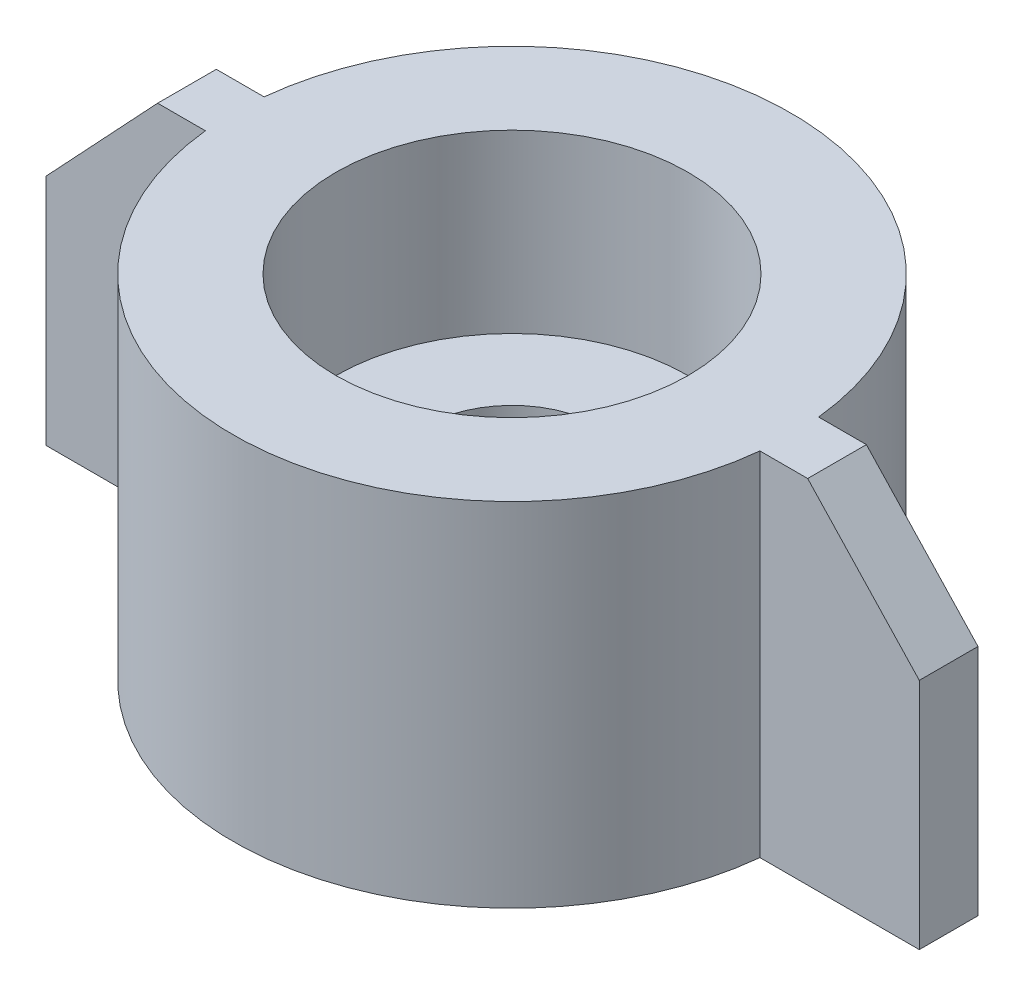
ISO-10303-21;
HEADER;
FILE_DESCRIPTION(('STEP AP214'),'2;1');
FILE_NAME('part.step','',(''),(''),'','','');
FILE_SCHEMA(('AUTOMOTIVE_DESIGN { 1 0 10303 214 1 1 1 1 }'));
ENDSEC;
DATA;
#1=APPLICATION_CONTEXT('core data for automotive mechanical design processes');
#2=APPLICATION_PROTOCOL_DEFINITION('international standard','automotive_design',2000,#1);
#3=PRODUCT_CONTEXT('',#1,'mechanical');
#4=PRODUCT('Part','Part','',(#3));
#5=PRODUCT_RELATED_PRODUCT_CATEGORY('part','',(#4));
#6=PRODUCT_DEFINITION_FORMATION('','',#4);
#7=PRODUCT_DEFINITION_CONTEXT('part definition',#1,'design');
#8=PRODUCT_DEFINITION('design','',#6,#7);
#9=PRODUCT_DEFINITION_SHAPE('','',#8);
#10=(LENGTH_UNIT() NAMED_UNIT(*) SI_UNIT(.MILLI.,.METRE.));
#11=(NAMED_UNIT(*) PLANE_ANGLE_UNIT() SI_UNIT($,.RADIAN.));
#12=(NAMED_UNIT(*) SI_UNIT($,.STERADIAN.) SOLID_ANGLE_UNIT());
#13=UNCERTAINTY_MEASURE_WITH_UNIT(LENGTH_MEASURE(1.E-05),#10,'distance_accuracy_value','');
#14=(GEOMETRIC_REPRESENTATION_CONTEXT(3) GLOBAL_UNCERTAINTY_ASSIGNED_CONTEXT((#13)) GLOBAL_UNIT_ASSIGNED_CONTEXT((#10,
#11,#12)) REPRESENTATION_CONTEXT('',''));
#15=CARTESIAN_POINT('',(0.,0.,0.));
#16=DIRECTION('',(0.,0.,1.));
#17=DIRECTION('',(1.,0.,0.));
#18=AXIS2_PLACEMENT_3D('',#15,#16,#17);
#19=CARTESIAN_POINT('',(0.,12.,0.));
#20=DIRECTION('',(0.,-1.,0.));
#21=DIRECTION('',(0.,0.,-1.));
#22=AXIS2_PLACEMENT_3D('',#19,#20,#21);
#23=CYLINDRICAL_SURFACE('',#22,6.);
#24=CARTESIAN_POINT('',(0.,0.,0.));
#25=DIRECTION('',(0.,1.,0.));
#26=DIRECTION('',(0.,0.,1.));
#27=AXIS2_PLACEMENT_3D('',#24,#25,#26);
#28=CIRCLE('',#27,6.);
#29=CARTESIAN_POINT('',(0.,0.,6.));
#30=VERTEX_POINT('',#29);
#31=EDGE_CURVE('E178',#30,#30,#28,.T.);
#32=ORIENTED_EDGE('',*,*,#31,.F.);
#33=EDGE_LOOP('',(#32));
#34=FACE_BOUND('',#33,.T.);
#35=CARTESIAN_POINT('',(0.,4.,0.));
#36=DIRECTION('',(0.,1.,0.));
#37=DIRECTION('',(0.,0.,1.));
#38=AXIS2_PLACEMENT_3D('',#35,#36,#37);
#39=CIRCLE('',#38,6.);
#40=CARTESIAN_POINT('',(0.,4.,6.));
#41=VERTEX_POINT('',#40);
#42=EDGE_CURVE('E393',#41,#41,#39,.T.);
#43=ORIENTED_EDGE('',*,*,#42,.T.);
#44=EDGE_LOOP('',(#43));
#45=FACE_BOUND('',#44,.T.);
#46=ADVANCED_FACE('F33',(#34,#45),#23,.F.);
#47=CARTESIAN_POINT('',(0.,12.,0.));
#48=DIRECTION('',(0.,-1.,0.));
#49=DIRECTION('',(0.,0.,-1.));
#50=AXIS2_PLACEMENT_3D('',#47,#48,#49);
#51=CYLINDRICAL_SURFACE('',#50,9.5);
#52=DIRECTION('',(0.,-1.,0.));
#53=VECTOR('',#52,1.);
#54=CARTESIAN_POINT('',(-9.44722181384559,12.,1.));
#55=LINE('',#54,#53);
#56=CARTESIAN_POINT('',(-9.44722181384559,0.,1.));
#57=VERTEX_POINT('',#56);
#58=CARTESIAN_POINT('',(-9.44722181384559,12.,1.));
#59=VERTEX_POINT('',#58);
#60=EDGE_CURVE('E152',#57,#59,#55,.F.);
#61=ORIENTED_EDGE('',*,*,#60,.F.);
#62=CARTESIAN_POINT('',(0.,0.,0.));
#63=DIRECTION('',(0.,1.,0.));
#64=DIRECTION('',(0.,0.,1.));
#65=AXIS2_PLACEMENT_3D('',#62,#63,#64);
#66=CIRCLE('',#65,9.5);
#67=CARTESIAN_POINT('',(9.44722181384559,0.,1.));
#68=VERTEX_POINT('',#67);
#69=EDGE_CURVE('E186',#57,#68,#66,.T.);
#70=ORIENTED_EDGE('',*,*,#69,.T.);
#71=DIRECTION('',(0.,-1.,0.));
#72=VECTOR('',#71,1.);
#73=CARTESIAN_POINT('',(9.44722181384559,12.,1.));
#74=LINE('',#73,#72);
#75=CARTESIAN_POINT('',(9.44722181384559,12.,1.));
#76=VERTEX_POINT('',#75);
#77=EDGE_CURVE('E192',#68,#76,#74,.F.);
#78=ORIENTED_EDGE('',*,*,#77,.T.);
#79=CARTESIAN_POINT('',(0.,12.,0.));
#80=DIRECTION('',(0.,1.,0.));
#81=DIRECTION('',(0.,0.,1.));
#82=AXIS2_PLACEMENT_3D('',#79,#80,#81);
#83=CIRCLE('',#82,9.5);
#84=EDGE_CURVE('E56',#59,#76,#83,.T.);
#85=ORIENTED_EDGE('',*,*,#84,.F.);
#86=EDGE_LOOP('',(#61,#70,#78,#85));
#87=FACE_BOUND('',#86,.T.);
#88=ADVANCED_FACE('F219',(#87),#51,.T.);
#89=CARTESIAN_POINT('',(9.44722181384559,0.,-1.));
#90=VERTEX_POINT('',#89);
#91=CARTESIAN_POINT('',(-9.44722181384559,0.,-1.));
#92=VERTEX_POINT('',#91);
#93=EDGE_CURVE('E193',#90,#92,#66,.T.);
#94=ORIENTED_EDGE('',*,*,#93,.T.);
#95=DIRECTION('',(0.,-1.,0.));
#96=VECTOR('',#95,1.);
#97=CARTESIAN_POINT('',(-9.44722181384559,12.,-1.));
#98=LINE('',#97,#96);
#99=CARTESIAN_POINT('',(-9.44722181384559,12.,-1.));
#100=VERTEX_POINT('',#99);
#101=EDGE_CURVE('E118',#92,#100,#98,.F.);
#102=ORIENTED_EDGE('',*,*,#101,.T.);
#103=CARTESIAN_POINT('',(9.44722181384559,12.,-1.));
#104=VERTEX_POINT('',#103);
#105=EDGE_CURVE('E189',#104,#100,#83,.T.);
#106=ORIENTED_EDGE('',*,*,#105,.F.);
#107=DIRECTION('',(0.,-1.,0.));
#108=VECTOR('',#107,1.);
#109=CARTESIAN_POINT('',(9.44722181384559,12.,-1.));
#110=LINE('',#109,#108);
#111=EDGE_CURVE('E41',#90,#104,#110,.F.);
#112=ORIENTED_EDGE('',*,*,#111,.F.);
#113=EDGE_LOOP('',(#94,#102,#106,#112));
#114=FACE_BOUND('',#113,.T.);
#115=ADVANCED_FACE('F35',(#114),#51,.T.);
#116=CARTESIAN_POINT('',(0.,12.,0.));
#117=DIRECTION('',(0.,1.,0.));
#118=DIRECTION('',(0.,0.,1.));
#119=AXIS2_PLACEMENT_3D('',#116,#117,#118);
#120=PLANE('',#119);
#121=ORIENTED_EDGE('',*,*,#105,.T.);
#122=DIRECTION('',(1.,0.,0.));
#123=VECTOR('',#122,1.);
#124=CARTESIAN_POINT('',(-11.0740312179161,12.,-1.));
#125=LINE('',#124,#123);
#126=CARTESIAN_POINT('',(-11.0740312179161,12.,-1.));
#127=VERTEX_POINT('',#126);
#128=EDGE_CURVE('E48',#127,#100,#125,.T.);
#129=ORIENTED_EDGE('',*,*,#128,.F.);
#130=DIRECTION('',(0.,0.,-1.));
#131=VECTOR('',#130,1.);
#132=CARTESIAN_POINT('',(-11.0740312179161,12.,1.));
#133=LINE('',#132,#131);
#134=CARTESIAN_POINT('',(-11.0740312179161,12.,1.));
#135=VERTEX_POINT('',#134);
#136=EDGE_CURVE('E148',#135,#127,#133,.T.);
#137=ORIENTED_EDGE('',*,*,#136,.F.);
#138=DIRECTION('',(1.,0.,0.));
#139=VECTOR('',#138,1.);
#140=CARTESIAN_POINT('',(-11.0740312179161,12.,1.));
#141=LINE('',#140,#139);
#142=EDGE_CURVE('E138',#135,#59,#141,.T.);
#143=ORIENTED_EDGE('',*,*,#142,.T.);
#144=ORIENTED_EDGE('',*,*,#84,.T.);
#145=DIRECTION('',(-1.,0.,0.));
#146=VECTOR('',#145,1.);
#147=CARTESIAN_POINT('',(11.0740312179161,12.,1.));
#148=LINE('',#147,#146);
#149=CARTESIAN_POINT('',(11.0740312179161,12.,1.));
#150=VERTEX_POINT('',#149);
#151=EDGE_CURVE('E154',#150,#76,#148,.T.);
#152=ORIENTED_EDGE('',*,*,#151,.F.);
#153=DIRECTION('',(0.,0.,1.));
#154=VECTOR('',#153,1.);
#155=CARTESIAN_POINT('',(11.0740312179161,12.,-1.));
#156=LINE('',#155,#154);
#157=CARTESIAN_POINT('',(11.0740312179161,12.,-1.));
#158=VERTEX_POINT('',#157);
#159=EDGE_CURVE('E176',#158,#150,#156,.T.);
#160=ORIENTED_EDGE('',*,*,#159,.F.);
#161=DIRECTION('',(-1.,0.,0.));
#162=VECTOR('',#161,1.);
#163=CARTESIAN_POINT('',(11.0740312179161,12.,-1.));
#164=LINE('',#163,#162);
#165=EDGE_CURVE('E164',#158,#104,#164,.T.);
#166=ORIENTED_EDGE('',*,*,#165,.T.);
#167=EDGE_LOOP('',(#121,#129,#137,#143,#144,#152,#160,#166));
#168=FACE_BOUND('',#167,.T.);
#169=CARTESIAN_POINT('',(0.,12.,0.));
#170=DIRECTION('',(0.,1.,0.));
#171=DIRECTION('',(0.,0.,1.));
#172=AXIS2_PLACEMENT_3D('',#169,#170,#171);
#173=CIRCLE('',#172,6.);
#174=CARTESIAN_POINT('',(0.,12.,6.));
#175=VERTEX_POINT('',#174);
#176=EDGE_CURVE('E183',#175,#175,#173,.T.);
#177=ORIENTED_EDGE('',*,*,#176,.F.);
#178=EDGE_LOOP('',(#177));
#179=FACE_BOUND('',#178,.T.);
#180=ADVANCED_FACE('F204',(#168,#179),#120,.T.);
#181=CARTESIAN_POINT('',(0.,0.,0.));
#182=DIRECTION('',(0.,1.,0.));
#183=DIRECTION('',(0.,0.,1.));
#184=AXIS2_PLACEMENT_3D('',#181,#182,#183);
#185=PLANE('',#184);
#186=ORIENTED_EDGE('',*,*,#69,.F.);
#187=DIRECTION('',(-1.,0.,0.));
#188=VECTOR('',#187,1.);
#189=CARTESIAN_POINT('',(-7.27132484583667,0.,1.));
#190=LINE('',#189,#188);
#191=CARTESIAN_POINT('',(-14.8767375899956,0.,1.));
#192=VERTEX_POINT('',#191);
#193=EDGE_CURVE('E128',#57,#192,#190,.T.);
#194=ORIENTED_EDGE('',*,*,#193,.T.);
#195=DIRECTION('',(0.,0.,-1.));
#196=VECTOR('',#195,1.);
#197=CARTESIAN_POINT('',(-14.8767375899956,0.,1.));
#198=LINE('',#197,#196);
#199=CARTESIAN_POINT('',(-14.8767375899956,0.,-1.));
#200=VERTEX_POINT('',#199);
#201=EDGE_CURVE('E124',#192,#200,#198,.T.);
#202=ORIENTED_EDGE('',*,*,#201,.T.);
#203=DIRECTION('',(-1.,0.,0.));
#204=VECTOR('',#203,1.);
#205=CARTESIAN_POINT('',(-7.27132484583667,0.,-1.));
#206=LINE('',#205,#204);
#207=EDGE_CURVE('E112',#92,#200,#206,.T.);
#208=ORIENTED_EDGE('',*,*,#207,.F.);
#209=ORIENTED_EDGE('',*,*,#93,.F.);
#210=DIRECTION('',(1.,0.,0.));
#211=VECTOR('',#210,1.);
#212=CARTESIAN_POINT('',(7.27132484583667,0.,-1.));
#213=LINE('',#212,#211);
#214=CARTESIAN_POINT('',(14.8767375899956,0.,-1.));
#215=VERTEX_POINT('',#214);
#216=EDGE_CURVE('E167',#90,#215,#213,.T.);
#217=ORIENTED_EDGE('',*,*,#216,.T.);
#218=DIRECTION('',(0.,0.,1.));
#219=VECTOR('',#218,1.);
#220=CARTESIAN_POINT('',(14.8767375899956,0.,-1.));
#221=LINE('',#220,#219);
#222=CARTESIAN_POINT('',(14.8767375899956,0.,1.));
#223=VERTEX_POINT('',#222);
#224=EDGE_CURVE('E175',#215,#223,#221,.T.);
#225=ORIENTED_EDGE('',*,*,#224,.T.);
#226=DIRECTION('',(1.,0.,0.));
#227=VECTOR('',#226,1.);
#228=CARTESIAN_POINT('',(7.27132484583667,0.,1.));
#229=LINE('',#228,#227);
#230=EDGE_CURVE('E156',#68,#223,#229,.T.);
#231=ORIENTED_EDGE('',*,*,#230,.F.);
#232=EDGE_LOOP('',(#186,#194,#202,#208,#209,#217,#225,#231));
#233=FACE_BOUND('',#232,.T.);
#234=ORIENTED_EDGE('',*,*,#31,.T.);
#235=EDGE_LOOP('',(#234));
#236=FACE_BOUND('',#235,.T.);
#237=ADVANCED_FACE('F126',(#233,#236),#185,.F.);
#238=CARTESIAN_POINT('',(0.,6.,0.));
#239=DIRECTION('',(0.,1.,0.));
#240=DIRECTION('',(0.,0.,1.));
#241=AXIS2_PLACEMENT_3D('',#238,#239,#240);
#242=CIRCLE('',#241,6.);
#243=CARTESIAN_POINT('',(0.,6.,6.));
#244=VERTEX_POINT('',#243);
#245=EDGE_CURVE('E11',#244,#244,#242,.T.);
#246=ORIENTED_EDGE('',*,*,#245,.F.);
#247=EDGE_LOOP('',(#246));
#248=FACE_BOUND('',#247,.T.);
#249=ORIENTED_EDGE('',*,*,#176,.T.);
#250=EDGE_LOOP('',(#249));
#251=FACE_BOUND('',#250,.T.);
#252=ADVANCED_FACE('F239',(#248,#251),#23,.F.);
#253=CARTESIAN_POINT('',(0.,0.,-1.));
#254=DIRECTION('',(0.,0.,1.));
#255=DIRECTION('',(1.,0.,0.));
#256=AXIS2_PLACEMENT_3D('',#253,#254,#255);
#257=PLANE('',#256);
#258=ORIENTED_EDGE('',*,*,#216,.F.);
#259=ORIENTED_EDGE('',*,*,#111,.T.);
#260=ORIENTED_EDGE('',*,*,#165,.F.);
#261=DIRECTION('',(-0.684101861560455,0.729386483977815,0.));
#262=VECTOR('',#261,1.);
#263=CARTESIAN_POINT('',(14.8767375899956,7.94557070199414,-1.));
#264=LINE('',#263,#262);
#265=CARTESIAN_POINT('',(14.8767375899956,7.94557070199414,-1.));
#266=VERTEX_POINT('',#265);
#267=EDGE_CURVE('E172',#266,#158,#264,.T.);
#268=ORIENTED_EDGE('',*,*,#267,.F.);
#269=DIRECTION('',(0.,1.,0.));
#270=VECTOR('',#269,1.);
#271=CARTESIAN_POINT('',(14.8767375899956,0.,-1.));
#272=LINE('',#271,#270);
#273=EDGE_CURVE('E169',#215,#266,#272,.T.);
#274=ORIENTED_EDGE('',*,*,#273,.F.);
#275=EDGE_LOOP('',(#258,#259,#260,#268,#274));
#276=FACE_BOUND('',#275,.T.);
#277=ADVANCED_FACE('F199',(#276),#257,.F.);
#278=CARTESIAN_POINT('',(0.,0.,1.));
#279=DIRECTION('',(0.,0.,1.));
#280=DIRECTION('',(1.,0.,0.));
#281=AXIS2_PLACEMENT_3D('',#278,#279,#280);
#282=PLANE('',#281);
#283=ORIENTED_EDGE('',*,*,#77,.F.);
#284=ORIENTED_EDGE('',*,*,#230,.T.);
#285=DIRECTION('',(0.,1.,0.));
#286=VECTOR('',#285,1.);
#287=CARTESIAN_POINT('',(14.8767375899956,0.,1.));
#288=LINE('',#287,#286);
#289=CARTESIAN_POINT('',(14.8767375899956,7.94557070199414,1.));
#290=VERTEX_POINT('',#289);
#291=EDGE_CURVE('E158',#223,#290,#288,.T.);
#292=ORIENTED_EDGE('',*,*,#291,.T.);
#293=DIRECTION('',(-0.684101861560455,0.729386483977815,0.));
#294=VECTOR('',#293,1.);
#295=CARTESIAN_POINT('',(14.8767375899956,7.94557070199414,1.));
#296=LINE('',#295,#294);
#297=EDGE_CURVE('E161',#290,#150,#296,.T.);
#298=ORIENTED_EDGE('',*,*,#297,.T.);
#299=ORIENTED_EDGE('',*,*,#151,.T.);
#300=EDGE_LOOP('',(#283,#284,#292,#298,#299));
#301=FACE_BOUND('',#300,.T.);
#302=ADVANCED_FACE('F216',(#301),#282,.T.);
#303=CARTESIAN_POINT('',(14.8767375899956,7.94557070199414,-1.));
#304=DIRECTION('',(0.729386483977815,0.684101861560455,0.));
#305=DIRECTION('',(-0.684101861560455,0.729386483977815,0.));
#306=AXIS2_PLACEMENT_3D('',#303,#304,#305);
#307=PLANE('',#306);
#308=ORIENTED_EDGE('',*,*,#159,.T.);
#309=ORIENTED_EDGE('',*,*,#297,.F.);
#310=DIRECTION('',(0.,0.,1.));
#311=VECTOR('',#310,1.);
#312=CARTESIAN_POINT('',(14.8767375899956,7.94557070199414,-1.));
#313=LINE('',#312,#311);
#314=EDGE_CURVE('E179',#266,#290,#313,.T.);
#315=ORIENTED_EDGE('',*,*,#314,.F.);
#316=ORIENTED_EDGE('',*,*,#267,.T.);
#317=EDGE_LOOP('',(#308,#309,#315,#316));
#318=FACE_BOUND('',#317,.T.);
#319=ADVANCED_FACE('F212',(#318),#307,.T.);
#320=CARTESIAN_POINT('',(14.8767375899956,0.,-1.));
#321=DIRECTION('',(1.,0.,0.));
#322=DIRECTION('',(0.,0.,-1.));
#323=AXIS2_PLACEMENT_3D('',#320,#321,#322);
#324=PLANE('',#323);
#325=ORIENTED_EDGE('',*,*,#314,.T.);
#326=ORIENTED_EDGE('',*,*,#291,.F.);
#327=ORIENTED_EDGE('',*,*,#224,.F.);
#328=ORIENTED_EDGE('',*,*,#273,.T.);
#329=EDGE_LOOP('',(#325,#326,#327,#328));
#330=FACE_BOUND('',#329,.T.);
#331=ADVANCED_FACE('F210',(#330),#324,.T.);
#332=CARTESIAN_POINT('',(0.,0.,1.));
#333=DIRECTION('',(0.,0.,-1.));
#334=DIRECTION('',(-1.,0.,0.));
#335=AXIS2_PLACEMENT_3D('',#332,#333,#334);
#336=PLANE('',#335);
#337=ORIENTED_EDGE('',*,*,#193,.F.);
#338=ORIENTED_EDGE('',*,*,#60,.T.);
#339=ORIENTED_EDGE('',*,*,#142,.F.);
#340=DIRECTION('',(0.684101861560455,0.729386483977815,0.));
#341=VECTOR('',#340,1.);
#342=CARTESIAN_POINT('',(-14.8767375899956,7.94557070199414,1.));
#343=LINE('',#342,#341);
#344=CARTESIAN_POINT('',(-14.8767375899956,7.94557070199414,1.));
#345=VERTEX_POINT('',#344);
#346=EDGE_CURVE('E133',#345,#135,#343,.T.);
#347=ORIENTED_EDGE('',*,*,#346,.F.);
#348=DIRECTION('',(0.,1.,0.));
#349=VECTOR('',#348,1.);
#350=CARTESIAN_POINT('',(-14.8767375899956,0.,1.));
#351=LINE('',#350,#349);
#352=EDGE_CURVE('E144',#192,#345,#351,.T.);
#353=ORIENTED_EDGE('',*,*,#352,.F.);
#354=EDGE_LOOP('',(#337,#338,#339,#347,#353));
#355=FACE_BOUND('',#354,.T.);
#356=ADVANCED_FACE('F222',(#355),#336,.F.);
#357=CARTESIAN_POINT('',(0.,0.,-1.));
#358=DIRECTION('',(0.,0.,-1.));
#359=DIRECTION('',(-1.,0.,0.));
#360=AXIS2_PLACEMENT_3D('',#357,#358,#359);
#361=PLANE('',#360);
#362=ORIENTED_EDGE('',*,*,#101,.F.);
#363=ORIENTED_EDGE('',*,*,#207,.T.);
#364=DIRECTION('',(0.,1.,0.));
#365=VECTOR('',#364,1.);
#366=CARTESIAN_POINT('',(-14.8767375899956,0.,-1.));
#367=LINE('',#366,#365);
#368=CARTESIAN_POINT('',(-14.8767375899956,7.94557070199414,-1.));
#369=VERTEX_POINT('',#368);
#370=EDGE_CURVE('E116',#200,#369,#367,.T.);
#371=ORIENTED_EDGE('',*,*,#370,.T.);
#372=DIRECTION('',(0.684101861560455,0.729386483977815,0.));
#373=VECTOR('',#372,1.);
#374=CARTESIAN_POINT('',(-14.8767375899956,7.94557070199414,-1.));
#375=LINE('',#374,#373);
#376=EDGE_CURVE('E136',#369,#127,#375,.T.);
#377=ORIENTED_EDGE('',*,*,#376,.T.);
#378=ORIENTED_EDGE('',*,*,#128,.T.);
#379=EDGE_LOOP('',(#362,#363,#371,#377,#378));
#380=FACE_BOUND('',#379,.T.);
#381=ADVANCED_FACE('F114',(#380),#361,.T.);
#382=CARTESIAN_POINT('',(-14.8767375899956,7.94557070199414,1.));
#383=DIRECTION('',(-0.729386483977815,0.684101861560455,0.));
#384=DIRECTION('',(-0.684101861560455,-0.729386483977815,0.));
#385=AXIS2_PLACEMENT_3D('',#382,#383,#384);
#386=PLANE('',#385);
#387=ORIENTED_EDGE('',*,*,#136,.T.);
#388=ORIENTED_EDGE('',*,*,#376,.F.);
#389=DIRECTION('',(0.,0.,-1.));
#390=VECTOR('',#389,1.);
#391=CARTESIAN_POINT('',(-14.8767375899956,7.94557070199414,1.));
#392=LINE('',#391,#390);
#393=EDGE_CURVE('E132',#345,#369,#392,.T.);
#394=ORIENTED_EDGE('',*,*,#393,.F.);
#395=ORIENTED_EDGE('',*,*,#346,.T.);
#396=EDGE_LOOP('',(#387,#388,#394,#395));
#397=FACE_BOUND('',#396,.T.);
#398=ADVANCED_FACE('F225',(#397),#386,.T.);
#399=CARTESIAN_POINT('',(-14.8767375899956,0.,1.));
#400=DIRECTION('',(-1.,0.,0.));
#401=DIRECTION('',(0.,0.,1.));
#402=AXIS2_PLACEMENT_3D('',#399,#400,#401);
#403=PLANE('',#402);
#404=ORIENTED_EDGE('',*,*,#393,.T.);
#405=ORIENTED_EDGE('',*,*,#370,.F.);
#406=ORIENTED_EDGE('',*,*,#201,.F.);
#407=ORIENTED_EDGE('',*,*,#352,.T.);
#408=EDGE_LOOP('',(#404,#405,#406,#407));
#409=FACE_BOUND('',#408,.T.);
#410=ADVANCED_FACE('F135',(#409),#403,.T.);
#411=CARTESIAN_POINT('',(0.,6.,0.));
#412=DIRECTION('',(0.,1.,0.));
#413=DIRECTION('',(0.,0.,1.));
#414=AXIS2_PLACEMENT_3D('',#411,#412,#413);
#415=PLANE('',#414);
#416=ORIENTED_EDGE('',*,*,#245,.T.);
#417=EDGE_LOOP('',(#416));
#418=FACE_BOUND('',#417,.T.);
#419=CARTESIAN_POINT('',(0.,6.,0.));
#420=DIRECTION('',(0.,1.,0.));
#421=DIRECTION('',(0.,0.,1.));
#422=AXIS2_PLACEMENT_3D('',#419,#420,#421);
#423=CIRCLE('',#422,3.);
#424=CARTESIAN_POINT('',(0.,6.,3.));
#425=VERTEX_POINT('',#424);
#426=EDGE_CURVE('E387',#425,#425,#423,.T.);
#427=ORIENTED_EDGE('',*,*,#426,.F.);
#428=EDGE_LOOP('',(#427));
#429=FACE_BOUND('',#428,.T.);
#430=ADVANCED_FACE('F232',(#418,#429),#415,.T.);
#431=CARTESIAN_POINT('',(0.,4.,0.));
#432=DIRECTION('',(0.,1.,0.));
#433=DIRECTION('',(0.,0.,1.));
#434=AXIS2_PLACEMENT_3D('',#431,#432,#433);
#435=PLANE('',#434);
#436=ORIENTED_EDGE('',*,*,#42,.F.);
#437=EDGE_LOOP('',(#436));
#438=FACE_BOUND('',#437,.T.);
#439=CARTESIAN_POINT('',(0.,4.,0.));
#440=DIRECTION('',(0.,1.,0.));
#441=DIRECTION('',(0.,0.,1.));
#442=AXIS2_PLACEMENT_3D('',#439,#440,#441);
#443=CIRCLE('',#442,3.);
#444=CARTESIAN_POINT('',(0.,4.,3.));
#445=VERTEX_POINT('',#444);
#446=EDGE_CURVE('E390',#445,#445,#443,.T.);
#447=ORIENTED_EDGE('',*,*,#446,.T.);
#448=EDGE_LOOP('',(#447));
#449=FACE_BOUND('',#448,.T.);
#450=ADVANCED_FACE('F335',(#438,#449),#435,.F.);
#451=CARTESIAN_POINT('',(0.,6.,0.));
#452=DIRECTION('',(0.,-1.,0.));
#453=DIRECTION('',(0.,0.,-1.));
#454=AXIS2_PLACEMENT_3D('',#451,#452,#453);
#455=CYLINDRICAL_SURFACE('',#454,3.);
#456=ORIENTED_EDGE('',*,*,#426,.T.);
#457=EDGE_LOOP('',(#456));
#458=FACE_BOUND('',#457,.T.);
#459=ORIENTED_EDGE('',*,*,#446,.F.);
#460=EDGE_LOOP('',(#459));
#461=FACE_BOUND('',#460,.T.);
#462=ADVANCED_FACE('F345',(#458,#461),#455,.F.);
#463=CLOSED_SHELL('',(#46,#88,#115,#180,#237,#252,#277,#302,#319,#331,#356,#381,#398,#410,#430,
#450,#462));
#464=MANIFOLD_SOLID_BREP('B2',#463);
#465=ADVANCED_BREP_SHAPE_REPRESENTATION('',(#18,#464),#14);
#466=SHAPE_DEFINITION_REPRESENTATION(#9,#465);
ENDSEC;
END-ISO-10303-21;
